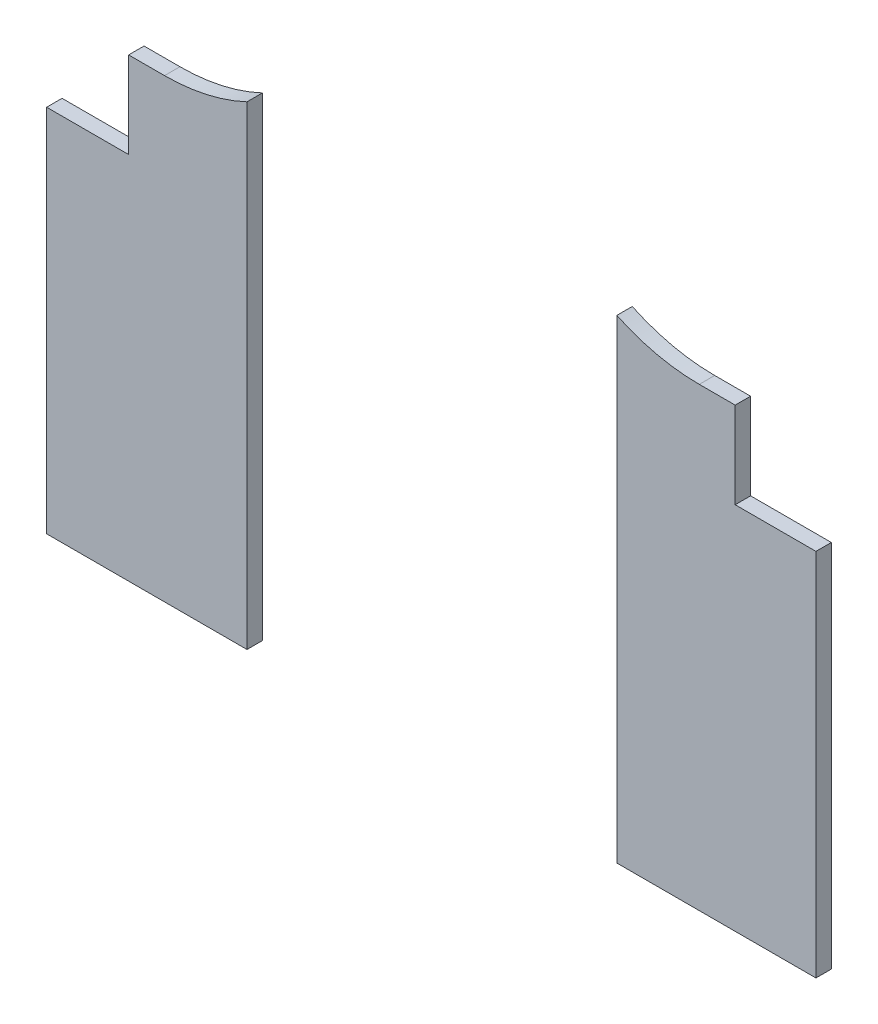
ISO-10303-21;
HEADER;
FILE_DESCRIPTION(('STEP AP214'),'2;1');
FILE_NAME('part.step','',(''),(''),'','','');
FILE_SCHEMA(('AUTOMOTIVE_DESIGN { 1 0 10303 214 1 1 1 1 }'));
ENDSEC;
DATA;
#1=APPLICATION_CONTEXT('core data for automotive mechanical design processes');
#2=APPLICATION_PROTOCOL_DEFINITION('international standard','automotive_design',2000,#1);
#3=PRODUCT_CONTEXT('',#1,'mechanical');
#4=PRODUCT('Part','Part','',(#3));
#5=PRODUCT_RELATED_PRODUCT_CATEGORY('part','',(#4));
#6=PRODUCT_DEFINITION_FORMATION('','',#4);
#7=PRODUCT_DEFINITION_CONTEXT('part definition',#1,'design');
#8=PRODUCT_DEFINITION('design','',#6,#7);
#9=PRODUCT_DEFINITION_SHAPE('','',#8);
#10=(LENGTH_UNIT() NAMED_UNIT(*) SI_UNIT(.MILLI.,.METRE.));
#11=(NAMED_UNIT(*) PLANE_ANGLE_UNIT() SI_UNIT($,.RADIAN.));
#12=(NAMED_UNIT(*) SI_UNIT($,.STERADIAN.) SOLID_ANGLE_UNIT());
#13=UNCERTAINTY_MEASURE_WITH_UNIT(LENGTH_MEASURE(1.E-05),#10,'distance_accuracy_value','');
#14=(GEOMETRIC_REPRESENTATION_CONTEXT(3) GLOBAL_UNCERTAINTY_ASSIGNED_CONTEXT((#13)) GLOBAL_UNIT_ASSIGNED_CONTEXT((#10,
#11,#12)) REPRESENTATION_CONTEXT('',''));
#15=CARTESIAN_POINT('',(0.,0.,0.));
#16=DIRECTION('',(0.,0.,1.));
#17=DIRECTION('',(1.,0.,0.));
#18=AXIS2_PLACEMENT_3D('',#15,#16,#17);
#19=CARTESIAN_POINT('',(0.,0.,5.));
#20=DIRECTION('',(0.,0.,1.));
#21=DIRECTION('',(1.,0.,0.));
#22=AXIS2_PLACEMENT_3D('',#19,#20,#21);
#23=PLANE('',#22);
#24=DIRECTION('',(0.,-1.,0.));
#25=VECTOR('',#24,1.);
#26=CARTESIAN_POINT('',(65.,-195.561220372056,5.));
#27=LINE('',#26,#25);
#28=CARTESIAN_POINT('',(65.,-41.6722394200107,5.));
#29=VERTEX_POINT('',#28);
#30=CARTESIAN_POINT('',(65.,-195.561220372056,5.));
#31=VERTEX_POINT('',#30);
#32=EDGE_CURVE('E12',#29,#31,#27,.T.);
#33=ORIENTED_EDGE('',*,*,#32,.F.);
#34=CARTESIAN_POINT('',(38.2503925080925,14.8141173312339,5.));
#35=DIRECTION('',(0.,0.,1.));
#36=DIRECTION('',(1.,0.,0.));
#37=AXIS2_PLACEMENT_3D('',#34,#35,#36);
#38=CIRCLE('',#37,62.5);
#39=CARTESIAN_POINT('',(38.2503925080925,-47.6858826687661,5.));
#40=VERTEX_POINT('',#39);
#41=EDGE_CURVE('E127',#40,#29,#38,.T.);
#42=ORIENTED_EDGE('',*,*,#41,.F.);
#43=DIRECTION('',(1.,0.,0.));
#44=VECTOR('',#43,1.);
#45=CARTESIAN_POINT('',(26.6043383580257,-47.6858826687661,5.));
#46=LINE('',#45,#44);
#47=CARTESIAN_POINT('',(26.6043383580257,-47.6858826687661,5.));
#48=VERTEX_POINT('',#47);
#49=EDGE_CURVE('E145',#48,#40,#46,.T.);
#50=ORIENTED_EDGE('',*,*,#49,.F.);
#51=DIRECTION('',(0.,1.,0.));
#52=VECTOR('',#51,1.);
#53=CARTESIAN_POINT('',(26.6043383580257,-75.685882668766,5.));
#54=LINE('',#53,#52);
#55=CARTESIAN_POINT('',(26.6043383580257,-75.685882668766,5.));
#56=VERTEX_POINT('',#55);
#57=EDGE_CURVE('E143',#56,#48,#54,.T.);
#58=ORIENTED_EDGE('',*,*,#57,.F.);
#59=DIRECTION('',(1.,0.,0.));
#60=VECTOR('',#59,1.);
#61=CARTESIAN_POINT('',(0.,-75.685882668766,5.));
#62=LINE('',#61,#60);
#63=CARTESIAN_POINT('',(0.,-75.685882668766,5.));
#64=VERTEX_POINT('',#63);
#65=EDGE_CURVE('E130',#64,#56,#62,.T.);
#66=ORIENTED_EDGE('',*,*,#65,.F.);
#67=DIRECTION('',(0.,-1.,0.));
#68=VECTOR('',#67,1.);
#69=CARTESIAN_POINT('',(0.,0.,5.));
#70=LINE('',#69,#68);
#71=CARTESIAN_POINT('',(0.,-195.561220372056,5.));
#72=VERTEX_POINT('',#71);
#73=EDGE_CURVE('E126',#64,#72,#70,.T.);
#74=ORIENTED_EDGE('',*,*,#73,.T.);
#75=DIRECTION('',(-1.,0.,0.));
#76=VECTOR('',#75,1.);
#77=CARTESIAN_POINT('',(0.,-195.561220372056,5.));
#78=LINE('',#77,#76);
#79=EDGE_CURVE('E48',#31,#72,#78,.T.);
#80=ORIENTED_EDGE('',*,*,#79,.F.);
#81=EDGE_LOOP('',(#33,#42,#50,#58,#66,#74,#80));
#82=FACE_BOUND('',#81,.T.);
#83=ADVANCED_FACE('F45',(#82),#23,.T.);
#84=CARTESIAN_POINT('',(0.,0.,0.));
#85=DIRECTION('',(0.,0.,1.));
#86=DIRECTION('',(1.,0.,0.));
#87=AXIS2_PLACEMENT_3D('',#84,#85,#86);
#88=PLANE('',#87);
#89=CARTESIAN_POINT('',(38.2503925080925,14.8141173312339,0.));
#90=DIRECTION('',(0.,0.,1.));
#91=DIRECTION('',(1.,0.,0.));
#92=AXIS2_PLACEMENT_3D('',#89,#90,#91);
#93=CIRCLE('',#92,62.5);
#94=CARTESIAN_POINT('',(38.2503925080925,-47.6858826687661,0.));
#95=VERTEX_POINT('',#94);
#96=CARTESIAN_POINT('',(65.,-41.6722394200107,0.));
#97=VERTEX_POINT('',#96);
#98=EDGE_CURVE('E131',#95,#97,#93,.T.);
#99=ORIENTED_EDGE('',*,*,#98,.T.);
#100=DIRECTION('',(0.,-1.,0.));
#101=VECTOR('',#100,1.);
#102=CARTESIAN_POINT('',(65.,-195.561220372056,0.));
#103=LINE('',#102,#101);
#104=CARTESIAN_POINT('',(65.,-195.561220372056,0.));
#105=VERTEX_POINT('',#104);
#106=EDGE_CURVE('E134',#97,#105,#103,.T.);
#107=ORIENTED_EDGE('',*,*,#106,.T.);
#108=DIRECTION('',(-1.,0.,0.));
#109=VECTOR('',#108,1.);
#110=CARTESIAN_POINT('',(0.,-195.561220372056,0.));
#111=LINE('',#110,#109);
#112=CARTESIAN_POINT('',(0.,-195.561220372056,0.));
#113=VERTEX_POINT('',#112);
#114=EDGE_CURVE('E110',#105,#113,#111,.T.);
#115=ORIENTED_EDGE('',*,*,#114,.T.);
#116=DIRECTION('',(0.,-1.,0.));
#117=VECTOR('',#116,1.);
#118=CARTESIAN_POINT('',(0.,0.,0.));
#119=LINE('',#118,#117);
#120=CARTESIAN_POINT('',(0.,-75.685882668766,0.));
#121=VERTEX_POINT('',#120);
#122=EDGE_CURVE('E122',#121,#113,#119,.T.);
#123=ORIENTED_EDGE('',*,*,#122,.F.);
#124=DIRECTION('',(1.,0.,0.));
#125=VECTOR('',#124,1.);
#126=CARTESIAN_POINT('',(0.,-75.685882668766,0.));
#127=LINE('',#126,#125);
#128=CARTESIAN_POINT('',(26.6043383580257,-75.685882668766,0.));
#129=VERTEX_POINT('',#128);
#130=EDGE_CURVE('E159',#121,#129,#127,.T.);
#131=ORIENTED_EDGE('',*,*,#130,.T.);
#132=DIRECTION('',(0.,1.,0.));
#133=VECTOR('',#132,1.);
#134=CARTESIAN_POINT('',(26.6043383580257,-75.685882668766,0.));
#135=LINE('',#134,#133);
#136=CARTESIAN_POINT('',(26.6043383580257,-47.6858826687661,0.));
#137=VERTEX_POINT('',#136);
#138=EDGE_CURVE('E156',#129,#137,#135,.T.);
#139=ORIENTED_EDGE('',*,*,#138,.T.);
#140=DIRECTION('',(1.,0.,0.));
#141=VECTOR('',#140,1.);
#142=CARTESIAN_POINT('',(26.6043383580257,-47.6858826687661,0.));
#143=LINE('',#142,#141);
#144=EDGE_CURVE('E153',#137,#95,#143,.T.);
#145=ORIENTED_EDGE('',*,*,#144,.T.);
#146=EDGE_LOOP('',(#99,#107,#115,#123,#131,#139,#145));
#147=FACE_BOUND('',#146,.T.);
#148=ADVANCED_FACE('F163',(#147),#88,.F.);
#149=CARTESIAN_POINT('',(0.,-195.561220372056,0.));
#150=DIRECTION('',(0.,1.,0.));
#151=DIRECTION('',(0.,0.,1.));
#152=AXIS2_PLACEMENT_3D('',#149,#150,#151);
#153=PLANE('',#152);
#154=ORIENTED_EDGE('',*,*,#114,.F.);
#155=DIRECTION('',(0.,0.,1.));
#156=VECTOR('',#155,1.);
#157=CARTESIAN_POINT('',(65.,-195.561220372056,0.));
#158=LINE('',#157,#156);
#159=EDGE_CURVE('E119',#105,#31,#158,.T.);
#160=ORIENTED_EDGE('',*,*,#159,.T.);
#161=ORIENTED_EDGE('',*,*,#79,.T.);
#162=DIRECTION('',(0.,0.,1.));
#163=VECTOR('',#162,1.);
#164=CARTESIAN_POINT('',(0.,-195.561220372056,0.));
#165=LINE('',#164,#163);
#166=EDGE_CURVE('E117',#113,#72,#165,.T.);
#167=ORIENTED_EDGE('',*,*,#166,.F.);
#168=EDGE_LOOP('',(#154,#160,#161,#167));
#169=FACE_BOUND('',#168,.T.);
#170=ADVANCED_FACE('F116',(#169),#153,.F.);
#171=CARTESIAN_POINT('',(0.,0.,5.));
#172=DIRECTION('',(1.,0.,0.));
#173=DIRECTION('',(0.,1.,0.));
#174=AXIS2_PLACEMENT_3D('',#171,#172,#173);
#175=PLANE('',#174);
#176=ORIENTED_EDGE('',*,*,#73,.F.);
#177=DIRECTION('',(0.,0.,1.));
#178=VECTOR('',#177,1.);
#179=CARTESIAN_POINT('',(0.,-75.685882668766,0.));
#180=LINE('',#179,#178);
#181=EDGE_CURVE('E54',#121,#64,#180,.T.);
#182=ORIENTED_EDGE('',*,*,#181,.F.);
#183=ORIENTED_EDGE('',*,*,#122,.T.);
#184=ORIENTED_EDGE('',*,*,#166,.T.);
#185=EDGE_LOOP('',(#176,#182,#183,#184));
#186=FACE_BOUND('',#185,.T.);
#187=ADVANCED_FACE('F125',(#186),#175,.F.);
#188=CARTESIAN_POINT('',(38.2503925080925,14.8141173312339,0.));
#189=DIRECTION('',(0.,0.,1.));
#190=DIRECTION('',(1.,0.,0.));
#191=AXIS2_PLACEMENT_3D('',#188,#189,#190);
#192=CYLINDRICAL_SURFACE('',#191,62.5);
#193=ORIENTED_EDGE('',*,*,#41,.T.);
#194=DIRECTION('',(0.,0.,1.));
#195=VECTOR('',#194,1.);
#196=CARTESIAN_POINT('',(65.,-41.6722394200107,0.));
#197=LINE('',#196,#195);
#198=EDGE_CURVE('E62',#29,#97,#197,.F.);
#199=ORIENTED_EDGE('',*,*,#198,.T.);
#200=ORIENTED_EDGE('',*,*,#98,.F.);
#201=DIRECTION('',(0.,0.,1.));
#202=VECTOR('',#201,1.);
#203=CARTESIAN_POINT('',(38.2503925080925,-47.6858826687661,0.));
#204=LINE('',#203,#202);
#205=EDGE_CURVE('E146',#95,#40,#204,.T.);
#206=ORIENTED_EDGE('',*,*,#205,.T.);
#207=EDGE_LOOP('',(#193,#199,#200,#206));
#208=FACE_BOUND('',#207,.T.);
#209=ADVANCED_FACE('F167',(#208),#192,.F.);
#210=CARTESIAN_POINT('',(26.6043383580257,-47.6858826687661,0.));
#211=DIRECTION('',(0.,-1.,0.));
#212=DIRECTION('',(1.,0.,0.));
#213=AXIS2_PLACEMENT_3D('',#210,#211,#212);
#214=PLANE('',#213);
#215=ORIENTED_EDGE('',*,*,#49,.T.);
#216=ORIENTED_EDGE('',*,*,#205,.F.);
#217=ORIENTED_EDGE('',*,*,#144,.F.);
#218=DIRECTION('',(0.,0.,1.));
#219=VECTOR('',#218,1.);
#220=CARTESIAN_POINT('',(26.6043383580257,-47.6858826687661,0.));
#221=LINE('',#220,#219);
#222=EDGE_CURVE('E96',#137,#48,#221,.T.);
#223=ORIENTED_EDGE('',*,*,#222,.T.);
#224=EDGE_LOOP('',(#215,#216,#217,#223));
#225=FACE_BOUND('',#224,.T.);
#226=ADVANCED_FACE('F170',(#225),#214,.F.);
#227=CARTESIAN_POINT('',(26.6043383580257,-75.685882668766,0.));
#228=DIRECTION('',(1.,0.,0.));
#229=DIRECTION('',(0.,0.,-1.));
#230=AXIS2_PLACEMENT_3D('',#227,#228,#229);
#231=PLANE('',#230);
#232=ORIENTED_EDGE('',*,*,#57,.T.);
#233=ORIENTED_EDGE('',*,*,#222,.F.);
#234=ORIENTED_EDGE('',*,*,#138,.F.);
#235=DIRECTION('',(0.,0.,1.));
#236=VECTOR('',#235,1.);
#237=CARTESIAN_POINT('',(26.6043383580257,-75.685882668766,0.));
#238=LINE('',#237,#236);
#239=EDGE_CURVE('E140',#129,#56,#238,.T.);
#240=ORIENTED_EDGE('',*,*,#239,.T.);
#241=EDGE_LOOP('',(#232,#233,#234,#240));
#242=FACE_BOUND('',#241,.T.);
#243=ADVANCED_FACE('F172',(#242),#231,.F.);
#244=CARTESIAN_POINT('',(0.,-75.685882668766,0.));
#245=DIRECTION('',(0.,-1.,0.));
#246=DIRECTION('',(0.,0.,-1.));
#247=AXIS2_PLACEMENT_3D('',#244,#245,#246);
#248=PLANE('',#247);
#249=ORIENTED_EDGE('',*,*,#65,.T.);
#250=ORIENTED_EDGE('',*,*,#239,.F.);
#251=ORIENTED_EDGE('',*,*,#130,.F.);
#252=ORIENTED_EDGE('',*,*,#181,.T.);
#253=EDGE_LOOP('',(#249,#250,#251,#252));
#254=FACE_BOUND('',#253,.T.);
#255=ADVANCED_FACE('F173',(#254),#248,.F.);
#256=CARTESIAN_POINT('',(65.,-195.561220372056,0.));
#257=DIRECTION('',(-1.,0.,0.));
#258=DIRECTION('',(0.,-1.,0.));
#259=AXIS2_PLACEMENT_3D('',#256,#257,#258);
#260=PLANE('',#259);
#261=ORIENTED_EDGE('',*,*,#32,.T.);
#262=ORIENTED_EDGE('',*,*,#159,.F.);
#263=ORIENTED_EDGE('',*,*,#106,.F.);
#264=ORIENTED_EDGE('',*,*,#198,.F.);
#265=EDGE_LOOP('',(#261,#262,#263,#264));
#266=FACE_BOUND('',#265,.T.);
#267=ADVANCED_FACE('F165',(#266),#260,.F.);
#268=CLOSED_SHELL('',(#83,#148,#170,#187,#209,#226,#243,#255,#267));
#269=MANIFOLD_SOLID_BREP('B2',#268);
#270=CARTESIAN_POINT('',(249.6,-75.685882668766,0.));
#271=DIRECTION('',(0.,-1.,0.));
#272=DIRECTION('',(0.,0.,-1.));
#273=AXIS2_PLACEMENT_3D('',#270,#271,#272);
#274=PLANE('',#273);
#275=DIRECTION('',(1.,0.,0.));
#276=VECTOR('',#275,1.);
#277=CARTESIAN_POINT('',(249.6,-75.685882668766,5.));
#278=LINE('',#277,#276);
#279=CARTESIAN_POINT('',(223.395661641974,-75.685882668766,5.));
#280=VERTEX_POINT('',#279);
#281=CARTESIAN_POINT('',(249.6,-75.685882668766,5.));
#282=VERTEX_POINT('',#281);
#283=EDGE_CURVE('E334',#280,#282,#278,.T.);
#284=ORIENTED_EDGE('',*,*,#283,.T.);
#285=DIRECTION('',(0.,0.,1.));
#286=VECTOR('',#285,1.);
#287=CARTESIAN_POINT('',(249.6,-75.685882668766,0.));
#288=LINE('',#287,#286);
#289=CARTESIAN_POINT('',(249.6,-75.685882668766,0.));
#290=VERTEX_POINT('',#289);
#291=EDGE_CURVE('E350',#290,#282,#288,.T.);
#292=ORIENTED_EDGE('',*,*,#291,.F.);
#293=DIRECTION('',(1.,0.,0.));
#294=VECTOR('',#293,1.);
#295=CARTESIAN_POINT('',(249.6,-75.685882668766,0.));
#296=LINE('',#295,#294);
#297=CARTESIAN_POINT('',(223.395661641974,-75.685882668766,0.));
#298=VERTEX_POINT('',#297);
#299=EDGE_CURVE('E338',#298,#290,#296,.T.);
#300=ORIENTED_EDGE('',*,*,#299,.F.);
#301=DIRECTION('',(0.,0.,1.));
#302=VECTOR('',#301,1.);
#303=CARTESIAN_POINT('',(223.395661641974,-75.685882668766,0.));
#304=LINE('',#303,#302);
#305=EDGE_CURVE('E353',#298,#280,#304,.T.);
#306=ORIENTED_EDGE('',*,*,#305,.T.);
#307=EDGE_LOOP('',(#284,#292,#300,#306));
#308=FACE_BOUND('',#307,.T.);
#309=ADVANCED_FACE('F247',(#308),#274,.F.);
#310=CARTESIAN_POINT('',(223.395661641974,-75.685882668766,0.));
#311=DIRECTION('',(-1.,0.,0.));
#312=DIRECTION('',(0.,0.,1.));
#313=AXIS2_PLACEMENT_3D('',#310,#311,#312);
#314=PLANE('',#313);
#315=DIRECTION('',(0.,-1.,0.));
#316=VECTOR('',#315,1.);
#317=CARTESIAN_POINT('',(223.395661641974,-75.685882668766,5.));
#318=LINE('',#317,#316);
#319=CARTESIAN_POINT('',(223.395661641974,-47.6858826687661,5.));
#320=VERTEX_POINT('',#319);
#321=EDGE_CURVE('E346',#320,#280,#318,.T.);
#322=ORIENTED_EDGE('',*,*,#321,.T.);
#323=ORIENTED_EDGE('',*,*,#305,.F.);
#324=DIRECTION('',(0.,-1.,0.));
#325=VECTOR('',#324,1.);
#326=CARTESIAN_POINT('',(223.395661641974,-75.685882668766,0.));
#327=LINE('',#326,#325);
#328=CARTESIAN_POINT('',(223.395661641974,-47.6858826687661,0.));
#329=VERTEX_POINT('',#328);
#330=EDGE_CURVE('E270',#329,#298,#327,.T.);
#331=ORIENTED_EDGE('',*,*,#330,.F.);
#332=DIRECTION('',(0.,0.,1.));
#333=VECTOR('',#332,1.);
#334=CARTESIAN_POINT('',(223.395661641974,-47.6858826687661,0.));
#335=LINE('',#334,#333);
#336=EDGE_CURVE('E355',#329,#320,#335,.T.);
#337=ORIENTED_EDGE('',*,*,#336,.T.);
#338=EDGE_LOOP('',(#322,#323,#331,#337));
#339=FACE_BOUND('',#338,.T.);
#340=ADVANCED_FACE('F366',(#339),#314,.F.);
#341=CARTESIAN_POINT('',(223.395661641974,-47.6858826687661,0.));
#342=DIRECTION('',(0.,-1.,0.));
#343=DIRECTION('',(0.,0.,-1.));
#344=AXIS2_PLACEMENT_3D('',#341,#342,#343);
#345=PLANE('',#344);
#346=DIRECTION('',(1.,0.,0.));
#347=VECTOR('',#346,1.);
#348=CARTESIAN_POINT('',(223.395661641974,-47.6858826687661,5.));
#349=LINE('',#348,#347);
#350=CARTESIAN_POINT('',(211.749607491907,-47.6858826687661,5.));
#351=VERTEX_POINT('',#350);
#352=EDGE_CURVE('E343',#351,#320,#349,.T.);
#353=ORIENTED_EDGE('',*,*,#352,.T.);
#354=ORIENTED_EDGE('',*,*,#336,.F.);
#355=DIRECTION('',(1.,0.,0.));
#356=VECTOR('',#355,1.);
#357=CARTESIAN_POINT('',(223.395661641974,-47.6858826687661,0.));
#358=LINE('',#357,#356);
#359=CARTESIAN_POINT('',(211.749607491907,-47.6858826687661,0.));
#360=VERTEX_POINT('',#359);
#361=EDGE_CURVE('E333',#360,#329,#358,.T.);
#362=ORIENTED_EDGE('',*,*,#361,.F.);
#363=DIRECTION('',(0.,0.,1.));
#364=VECTOR('',#363,1.);
#365=CARTESIAN_POINT('',(211.749607491907,-47.6858826687661,0.));
#366=LINE('',#365,#364);
#367=EDGE_CURVE('E341',#360,#351,#366,.T.);
#368=ORIENTED_EDGE('',*,*,#367,.T.);
#369=EDGE_LOOP('',(#353,#354,#362,#368));
#370=FACE_BOUND('',#369,.T.);
#371=ADVANCED_FACE('F361',(#370),#345,.F.);
#372=CARTESIAN_POINT('',(249.6,0.,5.));
#373=DIRECTION('',(-1.,0.,0.));
#374=DIRECTION('',(0.,-1.,0.));
#375=AXIS2_PLACEMENT_3D('',#372,#373,#374);
#376=PLANE('',#375);
#377=DIRECTION('',(0.,1.,0.));
#378=VECTOR('',#377,1.);
#379=CARTESIAN_POINT('',(249.6,0.,5.));
#380=LINE('',#379,#378);
#381=CARTESIAN_POINT('',(249.6,-195.561220372056,5.));
#382=VERTEX_POINT('',#381);
#383=EDGE_CURVE('E43',#382,#282,#380,.T.);
#384=ORIENTED_EDGE('',*,*,#383,.F.);
#385=DIRECTION('',(0.,0.,1.));
#386=VECTOR('',#385,1.);
#387=CARTESIAN_POINT('',(249.6,-195.561220372056,0.));
#388=LINE('',#387,#386);
#389=CARTESIAN_POINT('',(249.6,-195.561220372056,0.));
#390=VERTEX_POINT('',#389);
#391=EDGE_CURVE('E324',#390,#382,#388,.T.);
#392=ORIENTED_EDGE('',*,*,#391,.F.);
#393=DIRECTION('',(0.,1.,0.));
#394=VECTOR('',#393,1.);
#395=CARTESIAN_POINT('',(249.6,0.,0.));
#396=LINE('',#395,#394);
#397=EDGE_CURVE('E251',#390,#290,#396,.T.);
#398=ORIENTED_EDGE('',*,*,#397,.T.);
#399=ORIENTED_EDGE('',*,*,#291,.T.);
#400=EDGE_LOOP('',(#384,#392,#398,#399));
#401=FACE_BOUND('',#400,.T.);
#402=ADVANCED_FACE('F249',(#401),#376,.F.);
#403=CARTESIAN_POINT('',(211.749607491907,14.8141173312339,0.));
#404=DIRECTION('',(0.,0.,1.));
#405=DIRECTION('',(1.,0.,0.));
#406=AXIS2_PLACEMENT_3D('',#403,#404,#405);
#407=CYLINDRICAL_SURFACE('',#406,62.5);
#408=CARTESIAN_POINT('',(211.749607491907,14.8141173312339,0.));
#409=DIRECTION('',(0.,0.,1.));
#410=DIRECTION('',(-1.,0.,0.));
#411=AXIS2_PLACEMENT_3D('',#408,#409,#410);
#412=CIRCLE('',#411,62.5);
#413=CARTESIAN_POINT('',(185.,-41.6722394200108,0.));
#414=VERTEX_POINT('',#413);
#415=EDGE_CURVE('E331',#414,#360,#412,.T.);
#416=ORIENTED_EDGE('',*,*,#415,.F.);
#417=DIRECTION('',(0.,0.,1.));
#418=VECTOR('',#417,1.);
#419=CARTESIAN_POINT('',(185.,-41.6722394200109,0.));
#420=LINE('',#419,#418);
#421=CARTESIAN_POINT('',(185.,-41.6722394200108,5.));
#422=VERTEX_POINT('',#421);
#423=EDGE_CURVE('E311',#414,#422,#420,.T.);
#424=ORIENTED_EDGE('',*,*,#423,.T.);
#425=CARTESIAN_POINT('',(211.749607491907,14.8141173312339,5.));
#426=DIRECTION('',(0.,0.,1.));
#427=DIRECTION('',(-1.,0.,0.));
#428=AXIS2_PLACEMENT_3D('',#425,#426,#427);
#429=CIRCLE('',#428,62.5);
#430=EDGE_CURVE('E320',#422,#351,#429,.T.);
#431=ORIENTED_EDGE('',*,*,#430,.T.);
#432=ORIENTED_EDGE('',*,*,#367,.F.);
#433=EDGE_LOOP('',(#416,#424,#431,#432));
#434=FACE_BOUND('',#433,.T.);
#435=ADVANCED_FACE('F370',(#434),#407,.F.);
#436=CARTESIAN_POINT('',(0.,-195.561220372056,0.));
#437=DIRECTION('',(0.,1.,0.));
#438=DIRECTION('',(0.,0.,1.));
#439=AXIS2_PLACEMENT_3D('',#436,#437,#438);
#440=PLANE('',#439);
#441=DIRECTION('',(-1.,0.,0.));
#442=VECTOR('',#441,1.);
#443=CARTESIAN_POINT('',(0.,-195.561220372056,5.));
#444=LINE('',#443,#442);
#445=CARTESIAN_POINT('',(185.,-195.561220372056,5.));
#446=VERTEX_POINT('',#445);
#447=EDGE_CURVE('E317',#382,#446,#444,.T.);
#448=ORIENTED_EDGE('',*,*,#447,.T.);
#449=DIRECTION('',(0.,0.,1.));
#450=VECTOR('',#449,1.);
#451=CARTESIAN_POINT('',(185.,-195.561220372056,0.));
#452=LINE('',#451,#450);
#453=CARTESIAN_POINT('',(185.,-195.561220372056,0.));
#454=VERTEX_POINT('',#453);
#455=EDGE_CURVE('E303',#454,#446,#452,.T.);
#456=ORIENTED_EDGE('',*,*,#455,.F.);
#457=DIRECTION('',(-1.,0.,0.));
#458=VECTOR('',#457,1.);
#459=CARTESIAN_POINT('',(0.,-195.561220372056,0.));
#460=LINE('',#459,#458);
#461=EDGE_CURVE('E325',#390,#454,#460,.T.);
#462=ORIENTED_EDGE('',*,*,#461,.F.);
#463=ORIENTED_EDGE('',*,*,#391,.T.);
#464=EDGE_LOOP('',(#448,#456,#462,#463));
#465=FACE_BOUND('',#464,.T.);
#466=ADVANCED_FACE('F322',(#465),#440,.F.);
#467=CARTESIAN_POINT('',(0.,0.,0.));
#468=DIRECTION('',(0.,0.,1.));
#469=DIRECTION('',(1.,0.,0.));
#470=AXIS2_PLACEMENT_3D('',#467,#468,#469);
#471=PLANE('',#470);
#472=ORIENTED_EDGE('',*,*,#461,.T.);
#473=DIRECTION('',(0.,1.,0.));
#474=VECTOR('',#473,1.);
#475=CARTESIAN_POINT('',(185.,-195.561220372056,0.));
#476=LINE('',#475,#474);
#477=EDGE_CURVE('E262',#454,#414,#476,.T.);
#478=ORIENTED_EDGE('',*,*,#477,.T.);
#479=ORIENTED_EDGE('',*,*,#415,.T.);
#480=ORIENTED_EDGE('',*,*,#361,.T.);
#481=ORIENTED_EDGE('',*,*,#330,.T.);
#482=ORIENTED_EDGE('',*,*,#299,.T.);
#483=ORIENTED_EDGE('',*,*,#397,.F.);
#484=EDGE_LOOP('',(#472,#478,#479,#480,#481,#482,#483));
#485=FACE_BOUND('',#484,.T.);
#486=ADVANCED_FACE('F369',(#485),#471,.F.);
#487=CARTESIAN_POINT('',(0.,0.,5.));
#488=DIRECTION('',(0.,0.,1.));
#489=DIRECTION('',(1.,0.,0.));
#490=AXIS2_PLACEMENT_3D('',#487,#488,#489);
#491=PLANE('',#490);
#492=DIRECTION('',(0.,1.,0.));
#493=VECTOR('',#492,1.);
#494=CARTESIAN_POINT('',(185.,-195.561220372056,5.));
#495=LINE('',#494,#493);
#496=EDGE_CURVE('E306',#446,#422,#495,.T.);
#497=ORIENTED_EDGE('',*,*,#496,.F.);
#498=ORIENTED_EDGE('',*,*,#447,.F.);
#499=ORIENTED_EDGE('',*,*,#383,.T.);
#500=ORIENTED_EDGE('',*,*,#283,.F.);
#501=ORIENTED_EDGE('',*,*,#321,.F.);
#502=ORIENTED_EDGE('',*,*,#352,.F.);
#503=ORIENTED_EDGE('',*,*,#430,.F.);
#504=EDGE_LOOP('',(#497,#498,#499,#500,#501,#502,#503));
#505=FACE_BOUND('',#504,.T.);
#506=ADVANCED_FACE('F316',(#505),#491,.T.);
#507=CARTESIAN_POINT('',(185.,-195.561220372056,0.));
#508=DIRECTION('',(1.,0.,0.));
#509=DIRECTION('',(0.,1.,0.));
#510=AXIS2_PLACEMENT_3D('',#507,#508,#509);
#511=PLANE('',#510);
#512=ORIENTED_EDGE('',*,*,#477,.F.);
#513=ORIENTED_EDGE('',*,*,#455,.T.);
#514=ORIENTED_EDGE('',*,*,#496,.T.);
#515=ORIENTED_EDGE('',*,*,#423,.F.);
#516=EDGE_LOOP('',(#512,#513,#514,#515));
#517=FACE_BOUND('',#516,.T.);
#518=ADVANCED_FACE('F305',(#517),#511,.F.);
#519=CLOSED_SHELL('',(#309,#340,#371,#402,#435,#466,#486,#506,#518));
#520=MANIFOLD_SOLID_BREP('B6',#519);
#521=ADVANCED_BREP_SHAPE_REPRESENTATION('',(#18,#269,#520),#14);
#522=SHAPE_DEFINITION_REPRESENTATION(#9,#521);
ENDSEC;
END-ISO-10303-21;
